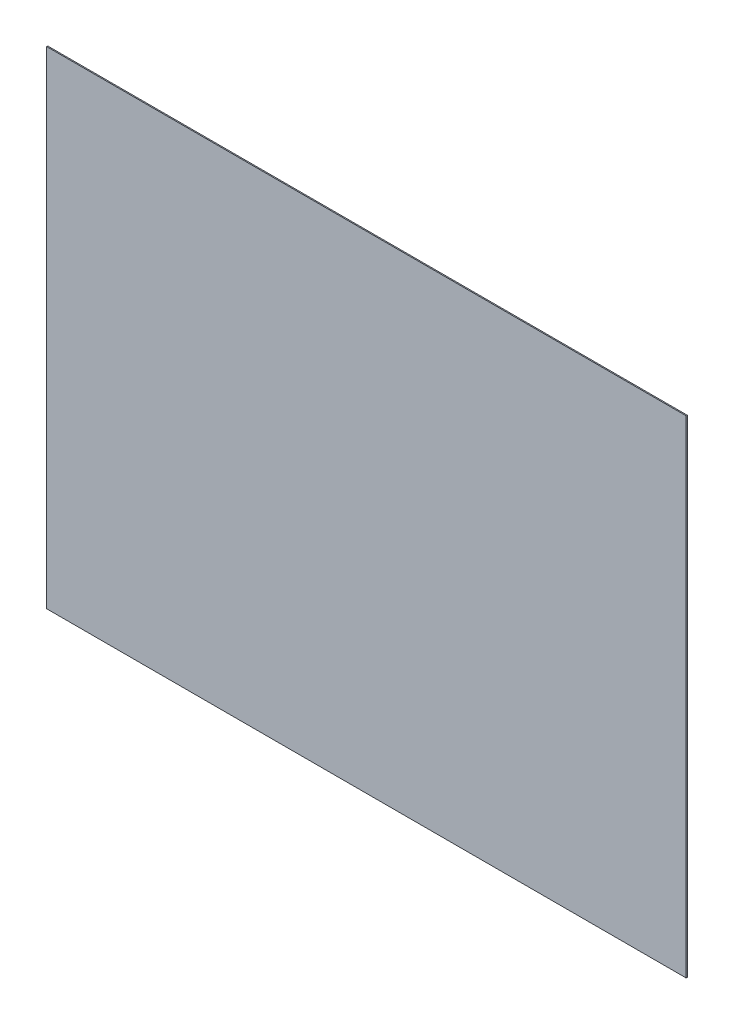
ISO-10303-21;
HEADER;
FILE_DESCRIPTION(('STEP AP214'),'2;1');
FILE_NAME('part.step','',(''),(''),'','','');
FILE_SCHEMA(('AUTOMOTIVE_DESIGN { 1 0 10303 214 1 1 1 1 }'));
ENDSEC;
DATA;
#1=APPLICATION_CONTEXT('core data for automotive mechanical design processes');
#2=APPLICATION_PROTOCOL_DEFINITION('international standard','automotive_design',2000,#1);
#3=PRODUCT_CONTEXT('',#1,'mechanical');
#4=PRODUCT('Part','Part','',(#3));
#5=PRODUCT_RELATED_PRODUCT_CATEGORY('part','',(#4));
#6=PRODUCT_DEFINITION_FORMATION('','',#4);
#7=PRODUCT_DEFINITION_CONTEXT('part definition',#1,'design');
#8=PRODUCT_DEFINITION('design','',#6,#7);
#9=PRODUCT_DEFINITION_SHAPE('','',#8);
#10=(LENGTH_UNIT() NAMED_UNIT(*) SI_UNIT(.MILLI.,.METRE.));
#11=(NAMED_UNIT(*) PLANE_ANGLE_UNIT() SI_UNIT($,.RADIAN.));
#12=(NAMED_UNIT(*) SI_UNIT($,.STERADIAN.) SOLID_ANGLE_UNIT());
#13=UNCERTAINTY_MEASURE_WITH_UNIT(LENGTH_MEASURE(1.E-05),#10,'distance_accuracy_value','');
#14=(GEOMETRIC_REPRESENTATION_CONTEXT(3) GLOBAL_UNCERTAINTY_ASSIGNED_CONTEXT((#13)) GLOBAL_UNIT_ASSIGNED_CONTEXT((#10,
#11,#12)) REPRESENTATION_CONTEXT('',''));
#15=CARTESIAN_POINT('',(0.,0.,0.));
#16=DIRECTION('',(0.,0.,1.));
#17=DIRECTION('',(1.,0.,0.));
#18=AXIS2_PLACEMENT_3D('',#15,#16,#17);
#19=CARTESIAN_POINT('',(295.5,225.,1.));
#20=DIRECTION('',(-1.,0.,0.));
#21=DIRECTION('',(0.,-1.,0.));
#22=AXIS2_PLACEMENT_3D('',#19,#20,#21);
#23=PLANE('',#22);
#24=DIRECTION('',(0.,1.,0.));
#25=VECTOR('',#24,1.);
#26=CARTESIAN_POINT('',(295.5,225.,0.));
#27=LINE('',#26,#25);
#28=CARTESIAN_POINT('',(295.5,-225.,0.));
#29=VERTEX_POINT('',#28);
#30=CARTESIAN_POINT('',(295.5,225.,0.));
#31=VERTEX_POINT('',#30);
#32=EDGE_CURVE('E96',#29,#31,#27,.T.);
#33=ORIENTED_EDGE('',*,*,#32,.T.);
#34=DIRECTION('',(0.,0.,-1.));
#35=VECTOR('',#34,1.);
#36=CARTESIAN_POINT('',(295.5,225.,1.));
#37=LINE('',#36,#35);
#38=CARTESIAN_POINT('',(295.5,225.,1.));
#39=VERTEX_POINT('',#38);
#40=EDGE_CURVE('E11',#39,#31,#37,.T.);
#41=ORIENTED_EDGE('',*,*,#40,.F.);
#42=DIRECTION('',(0.,1.,0.));
#43=VECTOR('',#42,1.);
#44=CARTESIAN_POINT('',(295.5,225.,1.));
#45=LINE('',#44,#43);
#46=CARTESIAN_POINT('',(295.5,-225.,1.));
#47=VERTEX_POINT('',#46);
#48=EDGE_CURVE('E84',#47,#39,#45,.T.);
#49=ORIENTED_EDGE('',*,*,#48,.F.);
#50=DIRECTION('',(0.,0.,-1.));
#51=VECTOR('',#50,1.);
#52=CARTESIAN_POINT('',(295.5,-225.,1.));
#53=LINE('',#52,#51);
#54=EDGE_CURVE('E92',#47,#29,#53,.T.);
#55=ORIENTED_EDGE('',*,*,#54,.T.);
#56=EDGE_LOOP('',(#33,#41,#49,#55));
#57=FACE_BOUND('',#56,.T.);
#58=ADVANCED_FACE('F33',(#57),#23,.F.);
#59=CARTESIAN_POINT('',(-295.5,225.,1.));
#60=DIRECTION('',(0.,-1.,0.));
#61=DIRECTION('',(0.,0.,-1.));
#62=AXIS2_PLACEMENT_3D('',#59,#60,#61);
#63=PLANE('',#62);
#64=DIRECTION('',(-1.,0.,0.));
#65=VECTOR('',#64,1.);
#66=CARTESIAN_POINT('',(-295.5,225.,0.));
#67=LINE('',#66,#65);
#68=CARTESIAN_POINT('',(-295.5,225.,0.));
#69=VERTEX_POINT('',#68);
#70=EDGE_CURVE('E88',#31,#69,#67,.T.);
#71=ORIENTED_EDGE('',*,*,#70,.T.);
#72=DIRECTION('',(0.,0.,-1.));
#73=VECTOR('',#72,1.);
#74=CARTESIAN_POINT('',(-295.5,225.,1.));
#75=LINE('',#74,#73);
#76=CARTESIAN_POINT('',(-295.5,225.,1.));
#77=VERTEX_POINT('',#76);
#78=EDGE_CURVE('E41',#77,#69,#75,.T.);
#79=ORIENTED_EDGE('',*,*,#78,.F.);
#80=DIRECTION('',(-1.,0.,0.));
#81=VECTOR('',#80,1.);
#82=CARTESIAN_POINT('',(-295.5,225.,1.));
#83=LINE('',#82,#81);
#84=EDGE_CURVE('E79',#39,#77,#83,.T.);
#85=ORIENTED_EDGE('',*,*,#84,.F.);
#86=ORIENTED_EDGE('',*,*,#40,.T.);
#87=EDGE_LOOP('',(#71,#79,#85,#86));
#88=FACE_BOUND('',#87,.T.);
#89=ADVANCED_FACE('F87',(#88),#63,.F.);
#90=CARTESIAN_POINT('',(-295.5,225.,1.));
#91=DIRECTION('',(1.,0.,0.));
#92=DIRECTION('',(0.,1.,0.));
#93=AXIS2_PLACEMENT_3D('',#90,#91,#92);
#94=PLANE('',#93);
#95=DIRECTION('',(0.,-1.,0.));
#96=VECTOR('',#95,1.);
#97=CARTESIAN_POINT('',(-295.5,225.,0.));
#98=LINE('',#97,#96);
#99=CARTESIAN_POINT('',(-295.5,-225.,0.));
#100=VERTEX_POINT('',#99);
#101=EDGE_CURVE('E66',#69,#100,#98,.T.);
#102=ORIENTED_EDGE('',*,*,#101,.T.);
#103=DIRECTION('',(0.,0.,-1.));
#104=VECTOR('',#103,1.);
#105=CARTESIAN_POINT('',(-295.5,-225.,1.));
#106=LINE('',#105,#104);
#107=CARTESIAN_POINT('',(-295.5,-225.,1.));
#108=VERTEX_POINT('',#107);
#109=EDGE_CURVE('E89',#108,#100,#106,.T.);
#110=ORIENTED_EDGE('',*,*,#109,.F.);
#111=DIRECTION('',(0.,-1.,0.));
#112=VECTOR('',#111,1.);
#113=CARTESIAN_POINT('',(-295.5,225.,1.));
#114=LINE('',#113,#112);
#115=EDGE_CURVE('E82',#77,#108,#114,.T.);
#116=ORIENTED_EDGE('',*,*,#115,.F.);
#117=ORIENTED_EDGE('',*,*,#78,.T.);
#118=EDGE_LOOP('',(#102,#110,#116,#117));
#119=FACE_BOUND('',#118,.T.);
#120=ADVANCED_FACE('F90',(#119),#94,.F.);
#121=CARTESIAN_POINT('',(-295.5,-225.,1.));
#122=DIRECTION('',(0.,1.,0.));
#123=DIRECTION('',(0.,0.,1.));
#124=AXIS2_PLACEMENT_3D('',#121,#122,#123);
#125=PLANE('',#124);
#126=DIRECTION('',(1.,0.,0.));
#127=VECTOR('',#126,1.);
#128=CARTESIAN_POINT('',(-295.5,-225.,0.));
#129=LINE('',#128,#127);
#130=EDGE_CURVE('E72',#100,#29,#129,.T.);
#131=ORIENTED_EDGE('',*,*,#130,.T.);
#132=ORIENTED_EDGE('',*,*,#54,.F.);
#133=DIRECTION('',(1.,0.,0.));
#134=VECTOR('',#133,1.);
#135=CARTESIAN_POINT('',(-295.5,-225.,1.));
#136=LINE('',#135,#134);
#137=EDGE_CURVE('E49',#108,#47,#136,.T.);
#138=ORIENTED_EDGE('',*,*,#137,.F.);
#139=ORIENTED_EDGE('',*,*,#109,.T.);
#140=EDGE_LOOP('',(#131,#132,#138,#139));
#141=FACE_BOUND('',#140,.T.);
#142=ADVANCED_FACE('F103',(#141),#125,.F.);
#143=CARTESIAN_POINT('',(0.,0.,1.));
#144=DIRECTION('',(0.,0.,1.));
#145=DIRECTION('',(1.,0.,0.));
#146=AXIS2_PLACEMENT_3D('',#143,#144,#145);
#147=PLANE('',#146);
#148=ORIENTED_EDGE('',*,*,#48,.T.);
#149=ORIENTED_EDGE('',*,*,#84,.T.);
#150=ORIENTED_EDGE('',*,*,#115,.T.);
#151=ORIENTED_EDGE('',*,*,#137,.T.);
#152=EDGE_LOOP('',(#148,#149,#150,#151));
#153=FACE_BOUND('',#152,.T.);
#154=ADVANCED_FACE('F80',(#153),#147,.T.);
#155=CARTESIAN_POINT('',(0.,0.,0.));
#156=DIRECTION('',(0.,0.,1.));
#157=DIRECTION('',(1.,0.,0.));
#158=AXIS2_PLACEMENT_3D('',#155,#156,#157);
#159=PLANE('',#158);
#160=ORIENTED_EDGE('',*,*,#32,.F.);
#161=ORIENTED_EDGE('',*,*,#130,.F.);
#162=ORIENTED_EDGE('',*,*,#101,.F.);
#163=ORIENTED_EDGE('',*,*,#70,.F.);
#164=EDGE_LOOP('',(#160,#161,#162,#163));
#165=FACE_BOUND('',#164,.T.);
#166=ADVANCED_FACE('F106',(#165),#159,.F.);
#167=CLOSED_SHELL('',(#58,#89,#120,#142,#154,#166));
#168=MANIFOLD_SOLID_BREP('B2',#167);
#169=ADVANCED_BREP_SHAPE_REPRESENTATION('',(#18,#168),#14);
#170=SHAPE_DEFINITION_REPRESENTATION(#9,#169);
ENDSEC;
END-ISO-10303-21;
